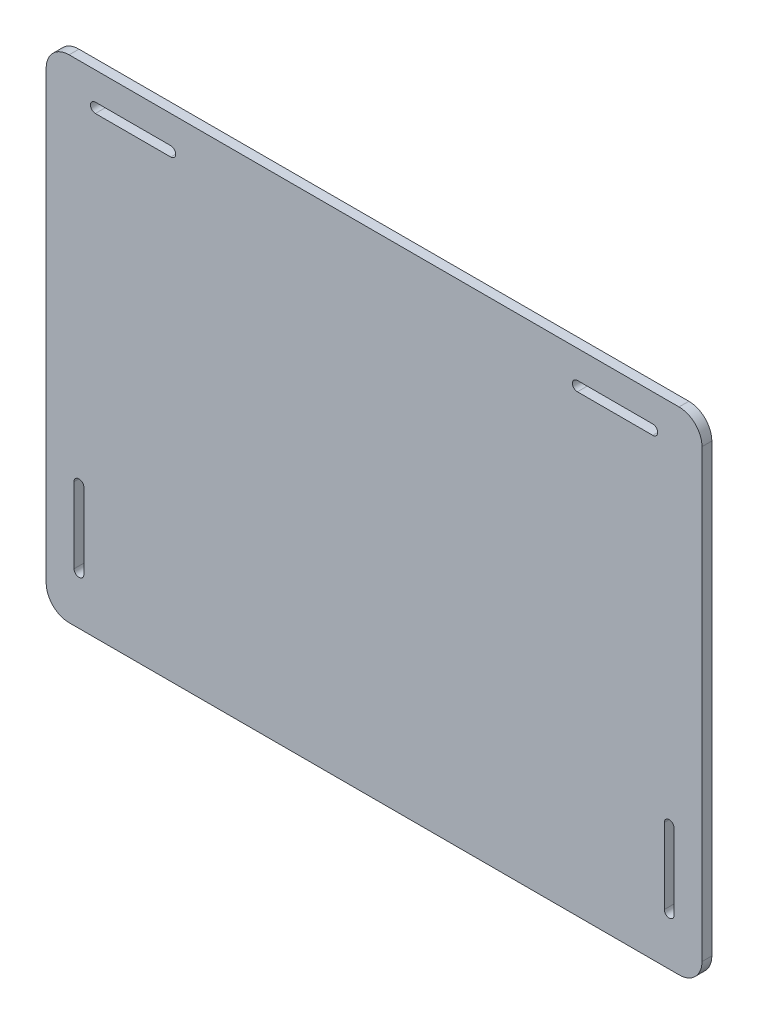
ISO-10303-21;
HEADER;
FILE_DESCRIPTION(('STEP AP214'),'2;1');
FILE_NAME('part.step','',(''),(''),'','','');
FILE_SCHEMA(('AUTOMOTIVE_DESIGN { 1 0 10303 214 1 1 1 1 }'));
ENDSEC;
DATA;
#1=APPLICATION_CONTEXT('core data for automotive mechanical design processes');
#2=APPLICATION_PROTOCOL_DEFINITION('international standard','automotive_design',2000,#1);
#3=PRODUCT_CONTEXT('',#1,'mechanical');
#4=PRODUCT('Part','Part','',(#3));
#5=PRODUCT_RELATED_PRODUCT_CATEGORY('part','',(#4));
#6=PRODUCT_DEFINITION_FORMATION('','',#4);
#7=PRODUCT_DEFINITION_CONTEXT('part definition',#1,'design');
#8=PRODUCT_DEFINITION('design','',#6,#7);
#9=PRODUCT_DEFINITION_SHAPE('','',#8);
#10=(LENGTH_UNIT() NAMED_UNIT(*) SI_UNIT(.MILLI.,.METRE.));
#11=(NAMED_UNIT(*) PLANE_ANGLE_UNIT() SI_UNIT($,.RADIAN.));
#12=(NAMED_UNIT(*) SI_UNIT($,.STERADIAN.) SOLID_ANGLE_UNIT());
#13=UNCERTAINTY_MEASURE_WITH_UNIT(LENGTH_MEASURE(1.E-05),#10,'distance_accuracy_value','');
#14=(GEOMETRIC_REPRESENTATION_CONTEXT(3) GLOBAL_UNCERTAINTY_ASSIGNED_CONTEXT((#13)) GLOBAL_UNIT_ASSIGNED_CONTEXT((#10,
#11,#12)) REPRESENTATION_CONTEXT('',''));
#15=CARTESIAN_POINT('',(0.,0.,0.));
#16=DIRECTION('',(0.,0.,1.));
#17=DIRECTION('',(1.,0.,0.));
#18=AXIS2_PLACEMENT_3D('',#15,#16,#17);
#19=CARTESIAN_POINT('',(-100.,75.,0.));
#20=DIRECTION('',(0.,-1.,0.));
#21=DIRECTION('',(0.,0.,-1.));
#22=AXIS2_PLACEMENT_3D('',#19,#20,#21);
#23=PLANE('',#22);
#24=DIRECTION('',(0.,0.,1.));
#25=VECTOR('',#24,1.);
#26=CARTESIAN_POINT('',(-93.,75.,1.5));
#27=LINE('',#26,#25);
#28=CARTESIAN_POINT('',(-93.,75.,0.));
#29=VERTEX_POINT('',#28);
#30=CARTESIAN_POINT('',(-93.,75.,3.));
#31=VERTEX_POINT('',#30);
#32=EDGE_CURVE('E10',#29,#31,#27,.T.);
#33=ORIENTED_EDGE('',*,*,#32,.T.);
#34=DIRECTION('',(-1.,0.,0.));
#35=VECTOR('',#34,1.);
#36=CARTESIAN_POINT('',(0.,75.,3.));
#37=LINE('',#36,#35);
#38=CARTESIAN_POINT('',(93.,75.,3.));
#39=VERTEX_POINT('',#38);
#40=EDGE_CURVE('E292',#39,#31,#37,.T.);
#41=ORIENTED_EDGE('',*,*,#40,.F.);
#42=DIRECTION('',(0.,0.,1.));
#43=VECTOR('',#42,1.);
#44=CARTESIAN_POINT('',(93.,75.,1.5));
#45=LINE('',#44,#43);
#46=CARTESIAN_POINT('',(93.,75.,0.));
#47=VERTEX_POINT('',#46);
#48=EDGE_CURVE('E231',#47,#39,#45,.T.);
#49=ORIENTED_EDGE('',*,*,#48,.F.);
#50=DIRECTION('',(-1.,0.,0.));
#51=VECTOR('',#50,1.);
#52=CARTESIAN_POINT('',(0.,75.,0.));
#53=LINE('',#52,#51);
#54=EDGE_CURVE('E334',#47,#29,#53,.T.);
#55=ORIENTED_EDGE('',*,*,#54,.T.);
#56=EDGE_LOOP('',(#33,#41,#49,#55));
#57=FACE_BOUND('',#56,.T.);
#58=ADVANCED_FACE('F16',(#57),#23,.F.);
#59=CARTESIAN_POINT('',(-93.,68.,1.5));
#60=DIRECTION('',(0.,0.,1.));
#61=DIRECTION('',(0.,1.,0.));
#62=AXIS2_PLACEMENT_3D('',#59,#60,#61);
#63=CYLINDRICAL_SURFACE('',#62,7.);
#64=CARTESIAN_POINT('',(-93.,68.,3.));
#65=DIRECTION('',(0.,0.,-1.));
#66=DIRECTION('',(1.,0.,0.));
#67=AXIS2_PLACEMENT_3D('',#64,#65,#66);
#68=CIRCLE('',#67,7.);
#69=CARTESIAN_POINT('',(-100.,68.,3.));
#70=VERTEX_POINT('',#69);
#71=EDGE_CURVE('E375',#70,#31,#68,.T.);
#72=ORIENTED_EDGE('',*,*,#71,.T.);
#73=ORIENTED_EDGE('',*,*,#32,.F.);
#74=CARTESIAN_POINT('',(-93.,68.,0.));
#75=DIRECTION('',(0.,0.,1.));
#76=DIRECTION('',(1.,0.,0.));
#77=AXIS2_PLACEMENT_3D('',#74,#75,#76);
#78=CIRCLE('',#77,7.);
#79=CARTESIAN_POINT('',(-100.,68.,0.));
#80=VERTEX_POINT('',#79);
#81=EDGE_CURVE('E337',#29,#80,#78,.T.);
#82=ORIENTED_EDGE('',*,*,#81,.T.);
#83=DIRECTION('',(0.,0.,1.));
#84=VECTOR('',#83,1.);
#85=CARTESIAN_POINT('',(-100.,68.,1.5));
#86=LINE('',#85,#84);
#87=EDGE_CURVE('E27',#80,#70,#86,.T.);
#88=ORIENTED_EDGE('',*,*,#87,.T.);
#89=EDGE_LOOP('',(#72,#73,#82,#88));
#90=FACE_BOUND('',#89,.T.);
#91=ADVANCED_FACE('F18',(#90),#63,.T.);
#92=CARTESIAN_POINT('',(-100.,-75.,0.));
#93=DIRECTION('',(1.,0.,0.));
#94=DIRECTION('',(0.,1.,0.));
#95=AXIS2_PLACEMENT_3D('',#92,#93,#94);
#96=PLANE('',#95);
#97=ORIENTED_EDGE('',*,*,#87,.F.);
#98=DIRECTION('',(0.,-1.,0.));
#99=VECTOR('',#98,1.);
#100=CARTESIAN_POINT('',(-100.,0.,0.));
#101=LINE('',#100,#99);
#102=CARTESIAN_POINT('',(-100.,-68.,0.));
#103=VERTEX_POINT('',#102);
#104=EDGE_CURVE('E348',#80,#103,#101,.T.);
#105=ORIENTED_EDGE('',*,*,#104,.T.);
#106=DIRECTION('',(0.,0.,1.));
#107=VECTOR('',#106,1.);
#108=CARTESIAN_POINT('',(-100.,-68.,1.5));
#109=LINE('',#108,#107);
#110=CARTESIAN_POINT('',(-100.,-68.,3.));
#111=VERTEX_POINT('',#110);
#112=EDGE_CURVE('E41',#103,#111,#109,.T.);
#113=ORIENTED_EDGE('',*,*,#112,.T.);
#114=DIRECTION('',(0.,-1.,0.));
#115=VECTOR('',#114,1.);
#116=CARTESIAN_POINT('',(-100.,0.,3.));
#117=LINE('',#116,#115);
#118=EDGE_CURVE('E367',#70,#111,#117,.T.);
#119=ORIENTED_EDGE('',*,*,#118,.F.);
#120=EDGE_LOOP('',(#97,#105,#113,#119));
#121=FACE_BOUND('',#120,.T.);
#122=ADVANCED_FACE('F531',(#121),#96,.F.);
#123=CARTESIAN_POINT('',(-93.,-68.,1.5));
#124=DIRECTION('',(0.,0.,1.));
#125=DIRECTION('',(-1.,0.,0.));
#126=AXIS2_PLACEMENT_3D('',#123,#124,#125);
#127=CYLINDRICAL_SURFACE('',#126,7.);
#128=CARTESIAN_POINT('',(-93.,-68.,3.));
#129=DIRECTION('',(0.,0.,-1.));
#130=DIRECTION('',(1.,0.,0.));
#131=AXIS2_PLACEMENT_3D('',#128,#129,#130);
#132=CIRCLE('',#131,7.);
#133=CARTESIAN_POINT('',(-93.,-75.,3.));
#134=VERTEX_POINT('',#133);
#135=EDGE_CURVE('E364',#134,#111,#132,.T.);
#136=ORIENTED_EDGE('',*,*,#135,.T.);
#137=ORIENTED_EDGE('',*,*,#112,.F.);
#138=CARTESIAN_POINT('',(-93.,-68.,0.));
#139=DIRECTION('',(0.,0.,1.));
#140=DIRECTION('',(1.,0.,0.));
#141=AXIS2_PLACEMENT_3D('',#138,#139,#140);
#142=CIRCLE('',#141,7.);
#143=CARTESIAN_POINT('',(-93.,-75.,0.));
#144=VERTEX_POINT('',#143);
#145=EDGE_CURVE('E308',#103,#144,#142,.T.);
#146=ORIENTED_EDGE('',*,*,#145,.T.);
#147=DIRECTION('',(0.,0.,1.));
#148=VECTOR('',#147,1.);
#149=CARTESIAN_POINT('',(-93.,-75.,1.5));
#150=LINE('',#149,#148);
#151=EDGE_CURVE('E311',#144,#134,#150,.T.);
#152=ORIENTED_EDGE('',*,*,#151,.T.);
#153=EDGE_LOOP('',(#136,#137,#146,#152));
#154=FACE_BOUND('',#153,.T.);
#155=ADVANCED_FACE('F535',(#154),#127,.T.);
#156=CARTESIAN_POINT('',(100.,-75.,0.));
#157=DIRECTION('',(0.,1.,0.));
#158=DIRECTION('',(1.,0.,0.));
#159=AXIS2_PLACEMENT_3D('',#156,#157,#158);
#160=PLANE('',#159);
#161=DIRECTION('',(0.,0.,1.));
#162=VECTOR('',#161,1.);
#163=CARTESIAN_POINT('',(93.,-75.,1.5));
#164=LINE('',#163,#162);
#165=CARTESIAN_POINT('',(93.,-75.,0.));
#166=VERTEX_POINT('',#165);
#167=CARTESIAN_POINT('',(93.,-75.,3.));
#168=VERTEX_POINT('',#167);
#169=EDGE_CURVE('E324',#166,#168,#164,.T.);
#170=ORIENTED_EDGE('',*,*,#169,.T.);
#171=DIRECTION('',(1.,0.,0.));
#172=VECTOR('',#171,1.);
#173=CARTESIAN_POINT('',(0.,-75.,3.));
#174=LINE('',#173,#172);
#175=EDGE_CURVE('E332',#134,#168,#174,.T.);
#176=ORIENTED_EDGE('',*,*,#175,.F.);
#177=ORIENTED_EDGE('',*,*,#151,.F.);
#178=DIRECTION('',(1.,0.,0.));
#179=VECTOR('',#178,1.);
#180=CARTESIAN_POINT('',(0.,-75.,0.));
#181=LINE('',#180,#179);
#182=EDGE_CURVE('E305',#144,#166,#181,.T.);
#183=ORIENTED_EDGE('',*,*,#182,.T.);
#184=EDGE_LOOP('',(#170,#176,#177,#183));
#185=FACE_BOUND('',#184,.T.);
#186=ADVANCED_FACE('F825',(#185),#160,.F.);
#187=CARTESIAN_POINT('',(93.,68.,1.5));
#188=DIRECTION('',(0.,0.,1.));
#189=DIRECTION('',(1.,0.,0.));
#190=AXIS2_PLACEMENT_3D('',#187,#188,#189);
#191=CYLINDRICAL_SURFACE('',#190,7.);
#192=CARTESIAN_POINT('',(93.,68.,3.));
#193=DIRECTION('',(0.,0.,-1.));
#194=DIRECTION('',(1.,0.,0.));
#195=AXIS2_PLACEMENT_3D('',#192,#193,#194);
#196=CIRCLE('',#195,7.);
#197=CARTESIAN_POINT('',(100.,68.,3.));
#198=VERTEX_POINT('',#197);
#199=EDGE_CURVE('E20',#39,#198,#196,.T.);
#200=ORIENTED_EDGE('',*,*,#199,.T.);
#201=DIRECTION('',(0.,0.,1.));
#202=VECTOR('',#201,1.);
#203=CARTESIAN_POINT('',(100.,68.,1.5));
#204=LINE('',#203,#202);
#205=CARTESIAN_POINT('',(100.,68.,0.));
#206=VERTEX_POINT('',#205);
#207=EDGE_CURVE('E351',#206,#198,#204,.T.);
#208=ORIENTED_EDGE('',*,*,#207,.F.);
#209=CARTESIAN_POINT('',(93.,68.,0.));
#210=DIRECTION('',(0.,0.,1.));
#211=DIRECTION('',(1.,0.,0.));
#212=AXIS2_PLACEMENT_3D('',#209,#210,#211);
#213=CIRCLE('',#212,7.);
#214=EDGE_CURVE('E336',#206,#47,#213,.T.);
#215=ORIENTED_EDGE('',*,*,#214,.T.);
#216=ORIENTED_EDGE('',*,*,#48,.T.);
#217=EDGE_LOOP('',(#200,#208,#215,#216));
#218=FACE_BOUND('',#217,.T.);
#219=ADVANCED_FACE('F541',(#218),#191,.T.);
#220=CARTESIAN_POINT('',(93.,-68.,1.5));
#221=DIRECTION('',(0.,0.,1.));
#222=DIRECTION('',(0.,-1.,0.));
#223=AXIS2_PLACEMENT_3D('',#220,#221,#222);
#224=CYLINDRICAL_SURFACE('',#223,7.);
#225=CARTESIAN_POINT('',(93.,-68.,3.));
#226=DIRECTION('',(0.,0.,-1.));
#227=DIRECTION('',(1.,0.,0.));
#228=AXIS2_PLACEMENT_3D('',#225,#226,#227);
#229=CIRCLE('',#228,7.);
#230=CARTESIAN_POINT('',(100.,-68.,3.));
#231=VERTEX_POINT('',#230);
#232=EDGE_CURVE('E328',#231,#168,#229,.T.);
#233=ORIENTED_EDGE('',*,*,#232,.T.);
#234=ORIENTED_EDGE('',*,*,#169,.F.);
#235=CARTESIAN_POINT('',(93.,-68.,0.));
#236=DIRECTION('',(0.,0.,1.));
#237=DIRECTION('',(1.,0.,0.));
#238=AXIS2_PLACEMENT_3D('',#235,#236,#237);
#239=CIRCLE('',#238,7.);
#240=CARTESIAN_POINT('',(100.,-68.,0.));
#241=VERTEX_POINT('',#240);
#242=EDGE_CURVE('E309',#166,#241,#239,.T.);
#243=ORIENTED_EDGE('',*,*,#242,.T.);
#244=DIRECTION('',(0.,0.,1.));
#245=VECTOR('',#244,1.);
#246=CARTESIAN_POINT('',(100.,-68.,1.5));
#247=LINE('',#246,#245);
#248=EDGE_CURVE('E405',#241,#231,#247,.T.);
#249=ORIENTED_EDGE('',*,*,#248,.T.);
#250=EDGE_LOOP('',(#233,#234,#243,#249));
#251=FACE_BOUND('',#250,.T.);
#252=ADVANCED_FACE('F537',(#251),#224,.T.);
#253=CARTESIAN_POINT('',(100.,75.,0.));
#254=DIRECTION('',(-1.,0.,0.));
#255=DIRECTION('',(0.,0.,1.));
#256=AXIS2_PLACEMENT_3D('',#253,#254,#255);
#257=PLANE('',#256);
#258=ORIENTED_EDGE('',*,*,#207,.T.);
#259=DIRECTION('',(0.,1.,0.));
#260=VECTOR('',#259,1.);
#261=CARTESIAN_POINT('',(100.,0.,3.));
#262=LINE('',#261,#260);
#263=EDGE_CURVE('E331',#231,#198,#262,.T.);
#264=ORIENTED_EDGE('',*,*,#263,.F.);
#265=ORIENTED_EDGE('',*,*,#248,.F.);
#266=DIRECTION('',(0.,1.,0.));
#267=VECTOR('',#266,1.);
#268=CARTESIAN_POINT('',(100.,0.,0.));
#269=LINE('',#268,#267);
#270=EDGE_CURVE('E417',#241,#206,#269,.T.);
#271=ORIENTED_EDGE('',*,*,#270,.T.);
#272=EDGE_LOOP('',(#258,#264,#265,#271));
#273=FACE_BOUND('',#272,.T.);
#274=ADVANCED_FACE('F540',(#273),#257,.F.);
#275=CARTESIAN_POINT('',(0.,0.,0.));
#276=DIRECTION('',(0.,0.,1.));
#277=DIRECTION('',(1.,0.,0.));
#278=AXIS2_PLACEMENT_3D('',#275,#276,#277);
#279=PLANE('',#278);
#280=DIRECTION('',(0.,1.,0.));
#281=VECTOR('',#280,1.);
#282=CARTESIAN_POINT('',(-88.5,-48.5,0.));
#283=LINE('',#282,#281);
#284=CARTESIAN_POINT('',(-88.5,-60.,0.));
#285=VERTEX_POINT('',#284);
#286=CARTESIAN_POINT('',(-88.5,-37.,0.));
#287=VERTEX_POINT('',#286);
#288=EDGE_CURVE('E173',#285,#287,#283,.T.);
#289=ORIENTED_EDGE('',*,*,#288,.T.);
#290=CARTESIAN_POINT('',(-90.,-37.,0.));
#291=DIRECTION('',(0.,0.,1.));
#292=DIRECTION('',(1.,0.,0.));
#293=AXIS2_PLACEMENT_3D('',#290,#291,#292);
#294=CIRCLE('',#293,1.5);
#295=CARTESIAN_POINT('',(-91.5,-37.,0.));
#296=VERTEX_POINT('',#295);
#297=EDGE_CURVE('E363',#287,#296,#294,.T.);
#298=ORIENTED_EDGE('',*,*,#297,.T.);
#299=DIRECTION('',(0.,-1.,0.));
#300=VECTOR('',#299,1.);
#301=CARTESIAN_POINT('',(-91.5,-48.5,0.));
#302=LINE('',#301,#300);
#303=CARTESIAN_POINT('',(-91.5,-60.,0.));
#304=VERTEX_POINT('',#303);
#305=EDGE_CURVE('E397',#296,#304,#302,.T.);
#306=ORIENTED_EDGE('',*,*,#305,.T.);
#307=CARTESIAN_POINT('',(-90.,-60.,0.));
#308=DIRECTION('',(0.,0.,1.));
#309=DIRECTION('',(1.,0.,0.));
#310=AXIS2_PLACEMENT_3D('',#307,#308,#309);
#311=CIRCLE('',#310,1.5);
#312=EDGE_CURVE('E404',#304,#285,#311,.T.);
#313=ORIENTED_EDGE('',*,*,#312,.T.);
#314=EDGE_LOOP('',(#289,#298,#306,#313));
#315=FACE_BOUND('',#314,.T.);
#316=CARTESIAN_POINT('',(-85.,65.,0.));
#317=DIRECTION('',(0.,0.,1.));
#318=DIRECTION('',(1.,0.,0.));
#319=AXIS2_PLACEMENT_3D('',#316,#317,#318);
#320=CIRCLE('',#319,1.5);
#321=CARTESIAN_POINT('',(-85.,66.5,0.));
#322=VERTEX_POINT('',#321);
#323=CARTESIAN_POINT('',(-85.,63.5,0.));
#324=VERTEX_POINT('',#323);
#325=EDGE_CURVE('E393',#322,#324,#320,.T.);
#326=ORIENTED_EDGE('',*,*,#325,.T.);
#327=DIRECTION('',(1.,0.,0.));
#328=VECTOR('',#327,1.);
#329=CARTESIAN_POINT('',(-73.5,63.5,0.));
#330=LINE('',#329,#328);
#331=CARTESIAN_POINT('',(-62.,63.5,0.));
#332=VERTEX_POINT('',#331);
#333=EDGE_CURVE('E378',#324,#332,#330,.T.);
#334=ORIENTED_EDGE('',*,*,#333,.T.);
#335=CARTESIAN_POINT('',(-62.,65.,0.));
#336=DIRECTION('',(0.,0.,1.));
#337=DIRECTION('',(1.,0.,0.));
#338=AXIS2_PLACEMENT_3D('',#335,#336,#337);
#339=CIRCLE('',#338,1.5);
#340=CARTESIAN_POINT('',(-62.,66.5,0.));
#341=VERTEX_POINT('',#340);
#342=EDGE_CURVE('E443',#332,#341,#339,.T.);
#343=ORIENTED_EDGE('',*,*,#342,.T.);
#344=DIRECTION('',(-1.,0.,0.));
#345=VECTOR('',#344,1.);
#346=CARTESIAN_POINT('',(-73.5,66.5,0.));
#347=LINE('',#346,#345);
#348=EDGE_CURVE('E356',#341,#322,#347,.T.);
#349=ORIENTED_EDGE('',*,*,#348,.T.);
#350=EDGE_LOOP('',(#326,#334,#343,#349));
#351=FACE_BOUND('',#350,.T.);
#352=CARTESIAN_POINT('',(90.,-37.,0.));
#353=DIRECTION('',(0.,0.,1.));
#354=DIRECTION('',(1.,0.,0.));
#355=AXIS2_PLACEMENT_3D('',#352,#353,#354);
#356=CIRCLE('',#355,1.5);
#357=CARTESIAN_POINT('',(91.5,-37.,0.));
#358=VERTEX_POINT('',#357);
#359=CARTESIAN_POINT('',(88.5,-37.,0.));
#360=VERTEX_POINT('',#359);
#361=EDGE_CURVE('E437',#358,#360,#356,.T.);
#362=ORIENTED_EDGE('',*,*,#361,.T.);
#363=DIRECTION('',(0.,-1.,0.));
#364=VECTOR('',#363,1.);
#365=CARTESIAN_POINT('',(88.5,-48.5,0.));
#366=LINE('',#365,#364);
#367=CARTESIAN_POINT('',(88.5,-60.,0.));
#368=VERTEX_POINT('',#367);
#369=EDGE_CURVE('E342',#360,#368,#366,.T.);
#370=ORIENTED_EDGE('',*,*,#369,.T.);
#371=CARTESIAN_POINT('',(90.,-60.,0.));
#372=DIRECTION('',(0.,0.,1.));
#373=DIRECTION('',(1.,0.,0.));
#374=AXIS2_PLACEMENT_3D('',#371,#372,#373);
#375=CIRCLE('',#374,1.5);
#376=CARTESIAN_POINT('',(91.5,-60.,0.));
#377=VERTEX_POINT('',#376);
#378=EDGE_CURVE('E294',#368,#377,#375,.T.);
#379=ORIENTED_EDGE('',*,*,#378,.T.);
#380=DIRECTION('',(0.,1.,0.));
#381=VECTOR('',#380,1.);
#382=CARTESIAN_POINT('',(91.5,-48.5,0.));
#383=LINE('',#382,#381);
#384=EDGE_CURVE('E300',#377,#358,#383,.T.);
#385=ORIENTED_EDGE('',*,*,#384,.T.);
#386=EDGE_LOOP('',(#362,#370,#379,#385));
#387=FACE_BOUND('',#386,.T.);
#388=DIRECTION('',(1.,0.,0.));
#389=VECTOR('',#388,1.);
#390=CARTESIAN_POINT('',(73.5,63.5,0.));
#391=LINE('',#390,#389);
#392=CARTESIAN_POINT('',(62.,63.5,0.));
#393=VERTEX_POINT('',#392);
#394=CARTESIAN_POINT('',(85.,63.5,0.));
#395=VERTEX_POINT('',#394);
#396=EDGE_CURVE('E266',#393,#395,#391,.T.);
#397=ORIENTED_EDGE('',*,*,#396,.T.);
#398=CARTESIAN_POINT('',(85.,65.,0.));
#399=DIRECTION('',(0.,0.,1.));
#400=DIRECTION('',(1.,0.,0.));
#401=AXIS2_PLACEMENT_3D('',#398,#399,#400);
#402=CIRCLE('',#401,1.5);
#403=CARTESIAN_POINT('',(85.,66.5,0.));
#404=VERTEX_POINT('',#403);
#405=EDGE_CURVE('E284',#395,#404,#402,.T.);
#406=ORIENTED_EDGE('',*,*,#405,.T.);
#407=DIRECTION('',(-1.,0.,0.));
#408=VECTOR('',#407,1.);
#409=CARTESIAN_POINT('',(73.5,66.5,0.));
#410=LINE('',#409,#408);
#411=CARTESIAN_POINT('',(62.,66.5,0.));
#412=VERTEX_POINT('',#411);
#413=EDGE_CURVE('E429',#404,#412,#410,.T.);
#414=ORIENTED_EDGE('',*,*,#413,.T.);
#415=CARTESIAN_POINT('',(62.,65.,0.));
#416=DIRECTION('',(0.,0.,1.));
#417=DIRECTION('',(1.,0.,0.));
#418=AXIS2_PLACEMENT_3D('',#415,#416,#417);
#419=CIRCLE('',#418,1.5);
#420=EDGE_CURVE('E428',#412,#393,#419,.T.);
#421=ORIENTED_EDGE('',*,*,#420,.T.);
#422=EDGE_LOOP('',(#397,#406,#414,#421));
#423=FACE_BOUND('',#422,.T.);
#424=ORIENTED_EDGE('',*,*,#81,.F.);
#425=ORIENTED_EDGE('',*,*,#54,.F.);
#426=ORIENTED_EDGE('',*,*,#214,.F.);
#427=ORIENTED_EDGE('',*,*,#270,.F.);
#428=ORIENTED_EDGE('',*,*,#242,.F.);
#429=ORIENTED_EDGE('',*,*,#182,.F.);
#430=ORIENTED_EDGE('',*,*,#145,.F.);
#431=ORIENTED_EDGE('',*,*,#104,.F.);
#432=EDGE_LOOP('',(#424,#425,#426,#427,#428,#429,#430,#431));
#433=FACE_BOUND('',#432,.T.);
#434=ADVANCED_FACE('F505',(#315,#351,#387,#423,#433),#279,.F.);
#435=CARTESIAN_POINT('',(0.,0.,3.));
#436=DIRECTION('',(0.,0.,1.));
#437=DIRECTION('',(1.,0.,0.));
#438=AXIS2_PLACEMENT_3D('',#435,#436,#437);
#439=PLANE('',#438);
#440=CARTESIAN_POINT('',(-90.,-60.,3.));
#441=DIRECTION('',(0.,0.,1.));
#442=DIRECTION('',(1.,0.,0.));
#443=AXIS2_PLACEMENT_3D('',#440,#441,#442);
#444=CIRCLE('',#443,1.5);
#445=CARTESIAN_POINT('',(-91.5,-60.,3.));
#446=VERTEX_POINT('',#445);
#447=CARTESIAN_POINT('',(-88.5,-60.,3.));
#448=VERTEX_POINT('',#447);
#449=EDGE_CURVE('E401',#446,#448,#444,.T.);
#450=ORIENTED_EDGE('',*,*,#449,.F.);
#451=DIRECTION('',(0.,-1.,0.));
#452=VECTOR('',#451,1.);
#453=CARTESIAN_POINT('',(-91.5,-48.5,3.));
#454=LINE('',#453,#452);
#455=CARTESIAN_POINT('',(-91.5,-37.,3.));
#456=VERTEX_POINT('',#455);
#457=EDGE_CURVE('E163',#456,#446,#454,.T.);
#458=ORIENTED_EDGE('',*,*,#457,.F.);
#459=CARTESIAN_POINT('',(-90.,-37.,3.));
#460=DIRECTION('',(0.,0.,1.));
#461=DIRECTION('',(1.,0.,0.));
#462=AXIS2_PLACEMENT_3D('',#459,#460,#461);
#463=CIRCLE('',#462,1.5);
#464=CARTESIAN_POINT('',(-88.5,-37.,3.));
#465=VERTEX_POINT('',#464);
#466=EDGE_CURVE('E355',#465,#456,#463,.T.);
#467=ORIENTED_EDGE('',*,*,#466,.F.);
#468=DIRECTION('',(0.,1.,0.));
#469=VECTOR('',#468,1.);
#470=CARTESIAN_POINT('',(-88.5,-48.5,3.));
#471=LINE('',#470,#469);
#472=EDGE_CURVE('E185',#448,#465,#471,.T.);
#473=ORIENTED_EDGE('',*,*,#472,.F.);
#474=EDGE_LOOP('',(#450,#458,#467,#473));
#475=FACE_BOUND('',#474,.T.);
#476=DIRECTION('',(-1.,0.,0.));
#477=VECTOR('',#476,1.);
#478=CARTESIAN_POINT('',(-73.5,66.5,3.));
#479=LINE('',#478,#477);
#480=CARTESIAN_POINT('',(-62.,66.5,3.));
#481=VERTEX_POINT('',#480);
#482=CARTESIAN_POINT('',(-85.,66.5,3.));
#483=VERTEX_POINT('',#482);
#484=EDGE_CURVE('E420',#481,#483,#479,.T.);
#485=ORIENTED_EDGE('',*,*,#484,.F.);
#486=CARTESIAN_POINT('',(-62.,65.,3.));
#487=DIRECTION('',(0.,0.,1.));
#488=DIRECTION('',(1.,0.,0.));
#489=AXIS2_PLACEMENT_3D('',#486,#487,#488);
#490=CIRCLE('',#489,1.5);
#491=CARTESIAN_POINT('',(-62.,63.5,3.));
#492=VERTEX_POINT('',#491);
#493=EDGE_CURVE('E388',#492,#481,#490,.T.);
#494=ORIENTED_EDGE('',*,*,#493,.F.);
#495=DIRECTION('',(1.,0.,0.));
#496=VECTOR('',#495,1.);
#497=CARTESIAN_POINT('',(-73.5,63.5,3.));
#498=LINE('',#497,#496);
#499=CARTESIAN_POINT('',(-85.,63.5,3.));
#500=VERTEX_POINT('',#499);
#501=EDGE_CURVE('E371',#500,#492,#498,.T.);
#502=ORIENTED_EDGE('',*,*,#501,.F.);
#503=CARTESIAN_POINT('',(-85.,65.,3.));
#504=DIRECTION('',(0.,0.,1.));
#505=DIRECTION('',(1.,0.,0.));
#506=AXIS2_PLACEMENT_3D('',#503,#504,#505);
#507=CIRCLE('',#506,1.5);
#508=EDGE_CURVE('E424',#483,#500,#507,.T.);
#509=ORIENTED_EDGE('',*,*,#508,.F.);
#510=EDGE_LOOP('',(#485,#494,#502,#509));
#511=FACE_BOUND('',#510,.T.);
#512=DIRECTION('',(0.,1.,0.));
#513=VECTOR('',#512,1.);
#514=CARTESIAN_POINT('',(91.5,-48.5,3.));
#515=LINE('',#514,#513);
#516=CARTESIAN_POINT('',(91.5,-60.,3.));
#517=VERTEX_POINT('',#516);
#518=CARTESIAN_POINT('',(91.5,-37.,3.));
#519=VERTEX_POINT('',#518);
#520=EDGE_CURVE('E304',#517,#519,#515,.T.);
#521=ORIENTED_EDGE('',*,*,#520,.F.);
#522=CARTESIAN_POINT('',(90.,-60.,3.));
#523=DIRECTION('',(0.,0.,1.));
#524=DIRECTION('',(1.,0.,0.));
#525=AXIS2_PLACEMENT_3D('',#522,#523,#524);
#526=CIRCLE('',#525,1.5);
#527=CARTESIAN_POINT('',(88.5,-60.,3.));
#528=VERTEX_POINT('',#527);
#529=EDGE_CURVE('E346',#528,#517,#526,.T.);
#530=ORIENTED_EDGE('',*,*,#529,.F.);
#531=DIRECTION('',(0.,-1.,0.));
#532=VECTOR('',#531,1.);
#533=CARTESIAN_POINT('',(88.5,-48.5,3.));
#534=LINE('',#533,#532);
#535=CARTESIAN_POINT('',(88.5,-37.,3.));
#536=VERTEX_POINT('',#535);
#537=EDGE_CURVE('E432',#536,#528,#534,.T.);
#538=ORIENTED_EDGE('',*,*,#537,.F.);
#539=CARTESIAN_POINT('',(90.,-37.,3.));
#540=DIRECTION('',(0.,0.,1.));
#541=DIRECTION('',(1.,0.,0.));
#542=AXIS2_PLACEMENT_3D('',#539,#540,#541);
#543=CIRCLE('',#542,1.5);
#544=EDGE_CURVE('E440',#519,#536,#543,.T.);
#545=ORIENTED_EDGE('',*,*,#544,.F.);
#546=EDGE_LOOP('',(#521,#530,#538,#545));
#547=FACE_BOUND('',#546,.T.);
#548=CARTESIAN_POINT('',(62.,65.,3.));
#549=DIRECTION('',(0.,0.,1.));
#550=DIRECTION('',(1.,0.,0.));
#551=AXIS2_PLACEMENT_3D('',#548,#549,#550);
#552=CIRCLE('',#551,1.5);
#553=CARTESIAN_POINT('',(62.,66.5,3.));
#554=VERTEX_POINT('',#553);
#555=CARTESIAN_POINT('',(62.,63.5,3.));
#556=VERTEX_POINT('',#555);
#557=EDGE_CURVE('E425',#554,#556,#552,.T.);
#558=ORIENTED_EDGE('',*,*,#557,.F.);
#559=DIRECTION('',(-1.,0.,0.));
#560=VECTOR('',#559,1.);
#561=CARTESIAN_POINT('',(73.5,66.5,3.));
#562=LINE('',#561,#560);
#563=CARTESIAN_POINT('',(85.,66.5,3.));
#564=VERTEX_POINT('',#563);
#565=EDGE_CURVE('E274',#564,#554,#562,.T.);
#566=ORIENTED_EDGE('',*,*,#565,.F.);
#567=CARTESIAN_POINT('',(85.,65.,3.));
#568=DIRECTION('',(0.,0.,1.));
#569=DIRECTION('',(1.,0.,0.));
#570=AXIS2_PLACEMENT_3D('',#567,#568,#569);
#571=CIRCLE('',#570,1.5);
#572=CARTESIAN_POINT('',(85.,63.5,3.));
#573=VERTEX_POINT('',#572);
#574=EDGE_CURVE('E270',#573,#564,#571,.T.);
#575=ORIENTED_EDGE('',*,*,#574,.F.);
#576=DIRECTION('',(1.,0.,0.));
#577=VECTOR('',#576,1.);
#578=CARTESIAN_POINT('',(73.5,63.5,3.));
#579=LINE('',#578,#577);
#580=EDGE_CURVE('E256',#556,#573,#579,.T.);
#581=ORIENTED_EDGE('',*,*,#580,.F.);
#582=EDGE_LOOP('',(#558,#566,#575,#581));
#583=FACE_BOUND('',#582,.T.);
#584=ORIENTED_EDGE('',*,*,#118,.T.);
#585=ORIENTED_EDGE('',*,*,#135,.F.);
#586=ORIENTED_EDGE('',*,*,#175,.T.);
#587=ORIENTED_EDGE('',*,*,#232,.F.);
#588=ORIENTED_EDGE('',*,*,#263,.T.);
#589=ORIENTED_EDGE('',*,*,#199,.F.);
#590=ORIENTED_EDGE('',*,*,#40,.T.);
#591=ORIENTED_EDGE('',*,*,#71,.F.);
#592=EDGE_LOOP('',(#584,#585,#586,#587,#588,#589,#590,#591));
#593=FACE_BOUND('',#592,.T.);
#594=ADVANCED_FACE('F271',(#475,#511,#547,#583,#593),#439,.T.);
#595=CARTESIAN_POINT('',(-90.,-60.,1.5));
#596=DIRECTION('',(0.,0.,1.));
#597=DIRECTION('',(-1.,0.,0.));
#598=AXIS2_PLACEMENT_3D('',#595,#596,#597);
#599=CYLINDRICAL_SURFACE('',#598,1.5);
#600=DIRECTION('',(0.,0.,-1.));
#601=VECTOR('',#600,1.);
#602=CARTESIAN_POINT('',(-91.5,-60.,1.5));
#603=LINE('',#602,#601);
#604=EDGE_CURVE('E341',#446,#304,#603,.T.);
#605=ORIENTED_EDGE('',*,*,#604,.F.);
#606=ORIENTED_EDGE('',*,*,#449,.T.);
#607=DIRECTION('',(0.,0.,-1.));
#608=VECTOR('',#607,1.);
#609=CARTESIAN_POINT('',(-88.5,-60.,1.5));
#610=LINE('',#609,#608);
#611=EDGE_CURVE('E359',#448,#285,#610,.T.);
#612=ORIENTED_EDGE('',*,*,#611,.T.);
#613=ORIENTED_EDGE('',*,*,#312,.F.);
#614=EDGE_LOOP('',(#605,#606,#612,#613));
#615=FACE_BOUND('',#614,.T.);
#616=ADVANCED_FACE('F552',(#615),#599,.F.);
#617=CARTESIAN_POINT('',(-91.5,-37.,3.));
#618=DIRECTION('',(1.,0.,0.));
#619=DIRECTION('',(0.,1.,0.));
#620=AXIS2_PLACEMENT_3D('',#617,#618,#619);
#621=PLANE('',#620);
#622=DIRECTION('',(0.,0.,-1.));
#623=VECTOR('',#622,1.);
#624=CARTESIAN_POINT('',(-91.5,-37.,1.5));
#625=LINE('',#624,#623);
#626=EDGE_CURVE('E473',#456,#296,#625,.T.);
#627=ORIENTED_EDGE('',*,*,#626,.F.);
#628=ORIENTED_EDGE('',*,*,#457,.T.);
#629=ORIENTED_EDGE('',*,*,#604,.T.);
#630=ORIENTED_EDGE('',*,*,#305,.F.);
#631=EDGE_LOOP('',(#627,#628,#629,#630));
#632=FACE_BOUND('',#631,.T.);
#633=ADVANCED_FACE('F549',(#632),#621,.T.);
#634=CARTESIAN_POINT('',(-88.5,-60.,3.));
#635=DIRECTION('',(-1.,0.,0.));
#636=DIRECTION('',(0.,0.,1.));
#637=AXIS2_PLACEMENT_3D('',#634,#635,#636);
#638=PLANE('',#637);
#639=ORIENTED_EDGE('',*,*,#611,.F.);
#640=ORIENTED_EDGE('',*,*,#472,.T.);
#641=DIRECTION('',(0.,0.,-1.));
#642=VECTOR('',#641,1.);
#643=CARTESIAN_POINT('',(-88.5,-37.,1.5));
#644=LINE('',#643,#642);
#645=EDGE_CURVE('E352',#465,#287,#644,.T.);
#646=ORIENTED_EDGE('',*,*,#645,.T.);
#647=ORIENTED_EDGE('',*,*,#288,.F.);
#648=EDGE_LOOP('',(#639,#640,#646,#647));
#649=FACE_BOUND('',#648,.T.);
#650=ADVANCED_FACE('F551',(#649),#638,.T.);
#651=CARTESIAN_POINT('',(-90.,-37.,1.5));
#652=DIRECTION('',(0.,0.,1.));
#653=DIRECTION('',(1.,0.,0.));
#654=AXIS2_PLACEMENT_3D('',#651,#652,#653);
#655=CYLINDRICAL_SURFACE('',#654,1.5);
#656=ORIENTED_EDGE('',*,*,#645,.F.);
#657=ORIENTED_EDGE('',*,*,#466,.T.);
#658=ORIENTED_EDGE('',*,*,#626,.T.);
#659=ORIENTED_EDGE('',*,*,#297,.F.);
#660=EDGE_LOOP('',(#656,#657,#658,#659));
#661=FACE_BOUND('',#660,.T.);
#662=ADVANCED_FACE('F863',(#661),#655,.F.);
#663=CARTESIAN_POINT('',(62.,66.5,3.));
#664=DIRECTION('',(0.,1.,0.));
#665=DIRECTION('',(1.,0.,0.));
#666=AXIS2_PLACEMENT_3D('',#663,#664,#665);
#667=PLANE('',#666);
#668=DIRECTION('',(0.,0.,-1.));
#669=VECTOR('',#668,1.);
#670=CARTESIAN_POINT('',(-62.,66.5,1.5));
#671=LINE('',#670,#669);
#672=EDGE_CURVE('E392',#481,#341,#671,.T.);
#673=ORIENTED_EDGE('',*,*,#672,.F.);
#674=ORIENTED_EDGE('',*,*,#484,.T.);
#675=DIRECTION('',(0.,0.,-1.));
#676=VECTOR('',#675,1.);
#677=CARTESIAN_POINT('',(-85.,66.5,1.5));
#678=LINE('',#677,#676);
#679=EDGE_CURVE('E382',#483,#322,#678,.T.);
#680=ORIENTED_EDGE('',*,*,#679,.T.);
#681=ORIENTED_EDGE('',*,*,#348,.F.);
#682=EDGE_LOOP('',(#673,#674,#680,#681));
#683=FACE_BOUND('',#682,.T.);
#684=ADVANCED_FACE('F850',(#683),#667,.F.);
#685=CARTESIAN_POINT('',(-62.,65.,1.5));
#686=DIRECTION('',(0.,0.,1.));
#687=DIRECTION('',(0.,-1.,0.));
#688=AXIS2_PLACEMENT_3D('',#685,#686,#687);
#689=CYLINDRICAL_SURFACE('',#688,1.5);
#690=DIRECTION('',(0.,0.,-1.));
#691=VECTOR('',#690,1.);
#692=CARTESIAN_POINT('',(-62.,63.5,1.5));
#693=LINE('',#692,#691);
#694=EDGE_CURVE('E383',#492,#332,#693,.T.);
#695=ORIENTED_EDGE('',*,*,#694,.F.);
#696=ORIENTED_EDGE('',*,*,#493,.T.);
#697=ORIENTED_EDGE('',*,*,#672,.T.);
#698=ORIENTED_EDGE('',*,*,#342,.F.);
#699=EDGE_LOOP('',(#695,#696,#697,#698));
#700=FACE_BOUND('',#699,.T.);
#701=ADVANCED_FACE('F547',(#700),#689,.F.);
#702=CARTESIAN_POINT('',(-85.,65.,1.5));
#703=DIRECTION('',(0.,0.,1.));
#704=DIRECTION('',(0.,1.,0.));
#705=AXIS2_PLACEMENT_3D('',#702,#703,#704);
#706=CYLINDRICAL_SURFACE('',#705,1.5);
#707=ORIENTED_EDGE('',*,*,#679,.F.);
#708=ORIENTED_EDGE('',*,*,#508,.T.);
#709=DIRECTION('',(0.,0.,-1.));
#710=VECTOR('',#709,1.);
#711=CARTESIAN_POINT('',(-85.,63.5,1.5));
#712=LINE('',#711,#710);
#713=EDGE_CURVE('E303',#500,#324,#712,.T.);
#714=ORIENTED_EDGE('',*,*,#713,.T.);
#715=ORIENTED_EDGE('',*,*,#325,.F.);
#716=EDGE_LOOP('',(#707,#708,#714,#715));
#717=FACE_BOUND('',#716,.T.);
#718=ADVANCED_FACE('F543',(#717),#706,.F.);
#719=CARTESIAN_POINT('',(85.,63.5,3.));
#720=DIRECTION('',(0.,-1.,0.));
#721=DIRECTION('',(0.,0.,-1.));
#722=AXIS2_PLACEMENT_3D('',#719,#720,#721);
#723=PLANE('',#722);
#724=ORIENTED_EDGE('',*,*,#713,.F.);
#725=ORIENTED_EDGE('',*,*,#501,.T.);
#726=ORIENTED_EDGE('',*,*,#694,.T.);
#727=ORIENTED_EDGE('',*,*,#333,.F.);
#728=EDGE_LOOP('',(#724,#725,#726,#727));
#729=FACE_BOUND('',#728,.T.);
#730=ADVANCED_FACE('F546',(#729),#723,.F.);
#731=CARTESIAN_POINT('',(91.5,-37.,3.));
#732=DIRECTION('',(1.,0.,0.));
#733=DIRECTION('',(0.,1.,0.));
#734=AXIS2_PLACEMENT_3D('',#731,#732,#733);
#735=PLANE('',#734);
#736=DIRECTION('',(0.,0.,-1.));
#737=VECTOR('',#736,1.);
#738=CARTESIAN_POINT('',(91.5,-60.,1.5));
#739=LINE('',#738,#737);
#740=EDGE_CURVE('E299',#517,#377,#739,.T.);
#741=ORIENTED_EDGE('',*,*,#740,.F.);
#742=ORIENTED_EDGE('',*,*,#520,.T.);
#743=DIRECTION('',(0.,0.,-1.));
#744=VECTOR('',#743,1.);
#745=CARTESIAN_POINT('',(91.5,-37.,1.5));
#746=LINE('',#745,#744);
#747=EDGE_CURVE('E298',#519,#358,#746,.T.);
#748=ORIENTED_EDGE('',*,*,#747,.T.);
#749=ORIENTED_EDGE('',*,*,#384,.F.);
#750=EDGE_LOOP('',(#741,#742,#748,#749));
#751=FACE_BOUND('',#750,.T.);
#752=ADVANCED_FACE('F829',(#751),#735,.F.);
#753=CARTESIAN_POINT('',(90.,-37.,1.5));
#754=DIRECTION('',(0.,0.,1.));
#755=DIRECTION('',(1.,0.,0.));
#756=AXIS2_PLACEMENT_3D('',#753,#754,#755);
#757=CYLINDRICAL_SURFACE('',#756,1.5);
#758=ORIENTED_EDGE('',*,*,#747,.F.);
#759=ORIENTED_EDGE('',*,*,#544,.T.);
#760=DIRECTION('',(0.,0.,-1.));
#761=VECTOR('',#760,1.);
#762=CARTESIAN_POINT('',(88.5,-37.,1.5));
#763=LINE('',#762,#761);
#764=EDGE_CURVE('E436',#536,#360,#763,.T.);
#765=ORIENTED_EDGE('',*,*,#764,.T.);
#766=ORIENTED_EDGE('',*,*,#361,.F.);
#767=EDGE_LOOP('',(#758,#759,#765,#766));
#768=FACE_BOUND('',#767,.T.);
#769=ADVANCED_FACE('F833',(#768),#757,.F.);
#770=CARTESIAN_POINT('',(90.,-60.,1.5));
#771=DIRECTION('',(0.,0.,1.));
#772=DIRECTION('',(-1.,0.,0.));
#773=AXIS2_PLACEMENT_3D('',#770,#771,#772);
#774=CYLINDRICAL_SURFACE('',#773,1.5);
#775=DIRECTION('',(0.,0.,-1.));
#776=VECTOR('',#775,1.);
#777=CARTESIAN_POINT('',(88.5,-60.,1.5));
#778=LINE('',#777,#776);
#779=EDGE_CURVE('E347',#528,#368,#778,.T.);
#780=ORIENTED_EDGE('',*,*,#779,.F.);
#781=ORIENTED_EDGE('',*,*,#529,.T.);
#782=ORIENTED_EDGE('',*,*,#740,.T.);
#783=ORIENTED_EDGE('',*,*,#378,.F.);
#784=EDGE_LOOP('',(#780,#781,#782,#783));
#785=FACE_BOUND('',#784,.T.);
#786=ADVANCED_FACE('F841',(#785),#774,.F.);
#787=CARTESIAN_POINT('',(88.5,-60.,3.));
#788=DIRECTION('',(-1.,0.,0.));
#789=DIRECTION('',(0.,0.,1.));
#790=AXIS2_PLACEMENT_3D('',#787,#788,#789);
#791=PLANE('',#790);
#792=ORIENTED_EDGE('',*,*,#764,.F.);
#793=ORIENTED_EDGE('',*,*,#537,.T.);
#794=ORIENTED_EDGE('',*,*,#779,.T.);
#795=ORIENTED_EDGE('',*,*,#369,.F.);
#796=EDGE_LOOP('',(#792,#793,#794,#795));
#797=FACE_BOUND('',#796,.T.);
#798=ADVANCED_FACE('F523',(#797),#791,.F.);
#799=CARTESIAN_POINT('',(62.,65.,1.5));
#800=DIRECTION('',(0.,0.,1.));
#801=DIRECTION('',(0.,1.,0.));
#802=AXIS2_PLACEMENT_3D('',#799,#800,#801);
#803=CYLINDRICAL_SURFACE('',#802,1.5);
#804=DIRECTION('',(0.,0.,-1.));
#805=VECTOR('',#804,1.);
#806=CARTESIAN_POINT('',(62.,66.5,1.5));
#807=LINE('',#806,#805);
#808=EDGE_CURVE('E448',#554,#412,#807,.T.);
#809=ORIENTED_EDGE('',*,*,#808,.F.);
#810=ORIENTED_EDGE('',*,*,#557,.T.);
#811=DIRECTION('',(0.,0.,-1.));
#812=VECTOR('',#811,1.);
#813=CARTESIAN_POINT('',(62.,63.5,1.5));
#814=LINE('',#813,#812);
#815=EDGE_CURVE('E263',#556,#393,#814,.T.);
#816=ORIENTED_EDGE('',*,*,#815,.T.);
#817=ORIENTED_EDGE('',*,*,#420,.F.);
#818=EDGE_LOOP('',(#809,#810,#816,#817));
#819=FACE_BOUND('',#818,.T.);
#820=ADVANCED_FACE('F509',(#819),#803,.F.);
#821=CARTESIAN_POINT('',(62.,66.5,3.));
#822=DIRECTION('',(0.,1.,0.));
#823=DIRECTION('',(1.,0.,0.));
#824=AXIS2_PLACEMENT_3D('',#821,#822,#823);
#825=PLANE('',#824);
#826=DIRECTION('',(0.,0.,-1.));
#827=VECTOR('',#826,1.);
#828=CARTESIAN_POINT('',(85.,66.5,1.5));
#829=LINE('',#828,#827);
#830=EDGE_CURVE('E279',#564,#404,#829,.T.);
#831=ORIENTED_EDGE('',*,*,#830,.F.);
#832=ORIENTED_EDGE('',*,*,#565,.T.);
#833=ORIENTED_EDGE('',*,*,#808,.T.);
#834=ORIENTED_EDGE('',*,*,#413,.F.);
#835=EDGE_LOOP('',(#831,#832,#833,#834));
#836=FACE_BOUND('',#835,.T.);
#837=ADVANCED_FACE('F511',(#836),#825,.F.);
#838=CARTESIAN_POINT('',(85.,63.5,3.));
#839=DIRECTION('',(0.,-1.,0.));
#840=DIRECTION('',(0.,0.,-1.));
#841=AXIS2_PLACEMENT_3D('',#838,#839,#840);
#842=PLANE('',#841);
#843=ORIENTED_EDGE('',*,*,#815,.F.);
#844=ORIENTED_EDGE('',*,*,#580,.T.);
#845=DIRECTION('',(0.,0.,-1.));
#846=VECTOR('',#845,1.);
#847=CARTESIAN_POINT('',(85.,63.5,1.5));
#848=LINE('',#847,#846);
#849=EDGE_CURVE('E261',#573,#395,#848,.T.);
#850=ORIENTED_EDGE('',*,*,#849,.T.);
#851=ORIENTED_EDGE('',*,*,#396,.F.);
#852=EDGE_LOOP('',(#843,#844,#850,#851));
#853=FACE_BOUND('',#852,.T.);
#854=ADVANCED_FACE('F258',(#853),#842,.F.);
#855=CARTESIAN_POINT('',(85.,65.,1.5));
#856=DIRECTION('',(0.,0.,1.));
#857=DIRECTION('',(0.,-1.,0.));
#858=AXIS2_PLACEMENT_3D('',#855,#856,#857);
#859=CYLINDRICAL_SURFACE('',#858,1.5);
#860=ORIENTED_EDGE('',*,*,#849,.F.);
#861=ORIENTED_EDGE('',*,*,#574,.T.);
#862=ORIENTED_EDGE('',*,*,#830,.T.);
#863=ORIENTED_EDGE('',*,*,#405,.F.);
#864=EDGE_LOOP('',(#860,#861,#862,#863));
#865=FACE_BOUND('',#864,.T.);
#866=ADVANCED_FACE('F282',(#865),#859,.F.);
#867=CLOSED_SHELL('',(#58,#91,#122,#155,#186,#219,#252,#274,#434,#594,#616,#633,#650,#662,#684,
#701,#718,#730,#752,#769,#786,#798,#820,#837,#854,#866));
#868=MANIFOLD_SOLID_BREP('B1',#867);
#869=ADVANCED_BREP_SHAPE_REPRESENTATION('',(#18,#868),#14);
#870=SHAPE_DEFINITION_REPRESENTATION(#9,#869);
ENDSEC;
END-ISO-10303-21;
